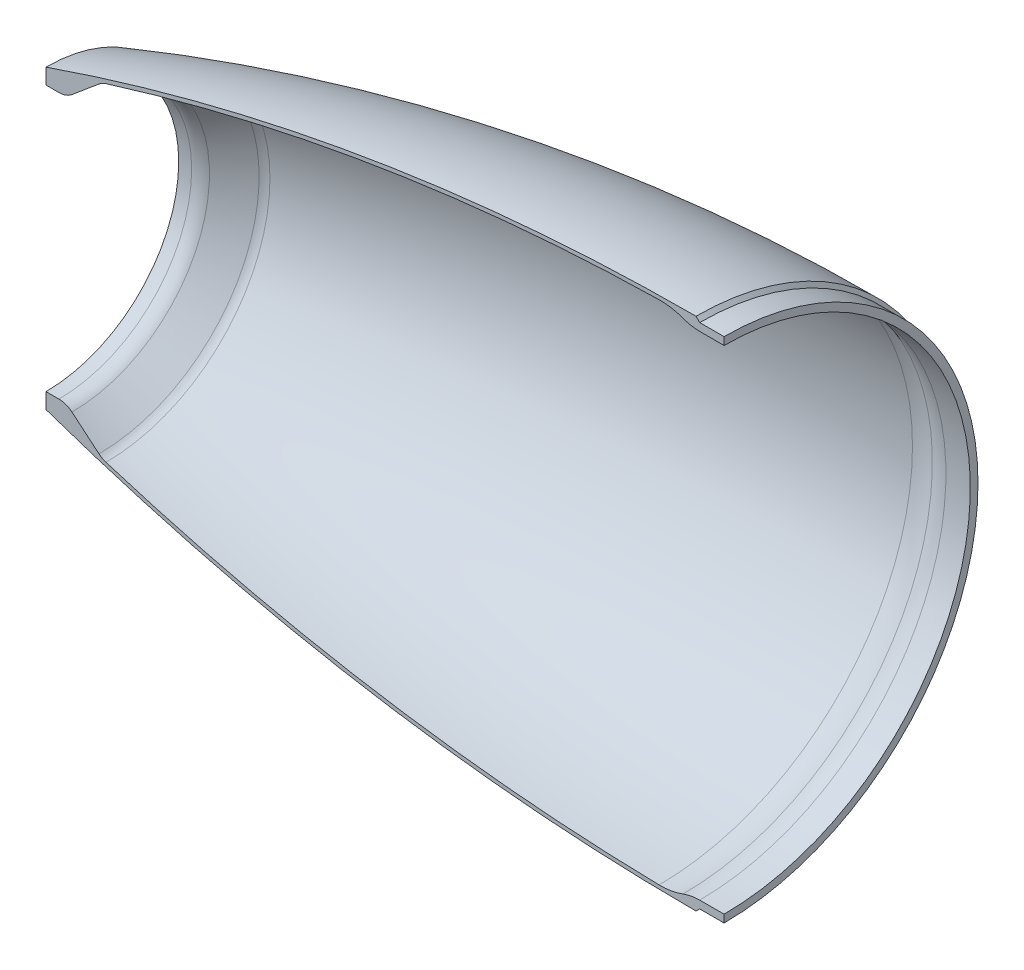
ISO-10303-21;
HEADER;
FILE_DESCRIPTION(('STEP AP214'),'2;1');
FILE_NAME('part.step','',(''),(''),'','','');
FILE_SCHEMA(('AUTOMOTIVE_DESIGN { 1 0 10303 214 1 1 1 1 }'));
ENDSEC;
DATA;
#1=APPLICATION_CONTEXT('core data for automotive mechanical design processes');
#2=APPLICATION_PROTOCOL_DEFINITION('international standard','automotive_design',2000,#1);
#3=PRODUCT_CONTEXT('',#1,'mechanical');
#4=PRODUCT('Part','Part','',(#3));
#5=PRODUCT_RELATED_PRODUCT_CATEGORY('part','',(#4));
#6=PRODUCT_DEFINITION_FORMATION('','',#4);
#7=PRODUCT_DEFINITION_CONTEXT('part definition',#1,'design');
#8=PRODUCT_DEFINITION('design','',#6,#7);
#9=PRODUCT_DEFINITION_SHAPE('','',#8);
#10=(LENGTH_UNIT() NAMED_UNIT(*) SI_UNIT(.MILLI.,.METRE.));
#11=(NAMED_UNIT(*) PLANE_ANGLE_UNIT() SI_UNIT($,.RADIAN.));
#12=(NAMED_UNIT(*) SI_UNIT($,.STERADIAN.) SOLID_ANGLE_UNIT());
#13=UNCERTAINTY_MEASURE_WITH_UNIT(LENGTH_MEASURE(1.E-05),#10,'distance_accuracy_value','');
#14=(GEOMETRIC_REPRESENTATION_CONTEXT(3) GLOBAL_UNCERTAINTY_ASSIGNED_CONTEXT((#13)) GLOBAL_UNIT_ASSIGNED_CONTEXT((#10,
#11,#12)) REPRESENTATION_CONTEXT('',''));
#15=CARTESIAN_POINT('',(0.,0.,0.));
#16=DIRECTION('',(0.,0.,1.));
#17=DIRECTION('',(1.,0.,0.));
#18=AXIS2_PLACEMENT_3D('',#15,#16,#17);
#19=CARTESIAN_POINT('',(-1.32216495746667E-13,0.,0.));
#20=DIRECTION('',(1.,0.,0.));
#21=DIRECTION('',(0.,1.,0.));
#22=AXIS2_PLACEMENT_3D('',#19,#20,#21);
#23=DEGENERATE_TOROIDAL_SURFACE('',#22,540.875767657992,621.393767657992,.F.);
#24=CARTESIAN_POINT('',(-203.2,0.,0.));
#25=DIRECTION('',(1.,0.,0.));
#26=DIRECTION('',(0.,1.,0.));
#27=AXIS2_PLACEMENT_3D('',#24,#25,#26);
#28=CIRCLE('',#27,46.355);
#29=CARTESIAN_POINT('',(-203.2,-46.355,3.23695234924147E-13));
#30=VERTEX_POINT('',#29);
#31=CARTESIAN_POINT('',(-203.2,46.355,0.));
#32=VERTEX_POINT('',#31);
#33=EDGE_CURVE('E11',#30,#32,#28,.T.);
#34=ORIENTED_EDGE('',*,*,#33,.T.);
#35=CARTESIAN_POINT('',(0.,-540.875767657992,0.));
#36=DIRECTION('',(0.,0.,1.));
#37=DIRECTION('',(1.,0.,0.));
#38=AXIS2_PLACEMENT_3D('',#35,#36,#37);
#39=CIRCLE('',#38,621.393767657992);
#40=CARTESIAN_POINT('',(0.,80.518,0.));
#41=VERTEX_POINT('',#40);
#42=EDGE_CURVE('E133',#41,#32,#39,.T.);
#43=ORIENTED_EDGE('',*,*,#42,.F.);
#44=CARTESIAN_POINT('',(0.,0.,0.));
#45=DIRECTION('',(1.,0.,0.));
#46=DIRECTION('',(0.,1.,0.));
#47=AXIS2_PLACEMENT_3D('',#44,#45,#46);
#48=CIRCLE('',#47,80.518);
#49=CARTESIAN_POINT('',(0.,-80.518,5.62254188881943E-13));
#50=VERTEX_POINT('',#49);
#51=EDGE_CURVE('E54',#50,#41,#48,.T.);
#52=ORIENTED_EDGE('',*,*,#51,.F.);
#53=CARTESIAN_POINT('',(-1.98454673506539E-13,540.875767657992,-3.77691529882066E-12));
#54=DIRECTION('',(0.,0.,-1.));
#55=DIRECTION('',(1.,0.,0.));
#56=AXIS2_PLACEMENT_3D('',#53,#54,#55);
#57=CIRCLE('',#56,621.393767657992);
#58=EDGE_CURVE('E135',#50,#30,#57,.T.);
#59=ORIENTED_EDGE('',*,*,#58,.T.);
#60=EDGE_LOOP('',(#34,#43,#52,#59));
#61=FACE_BOUND('',#60,.T.);
#62=ADVANCED_FACE('F39',(#61),#23,.F.);
#63=CARTESIAN_POINT('',(-203.2,-46.355,3.23695234924147E-13));
#64=DIRECTION('',(-1.,0.,0.));
#65=DIRECTION('',(0.,-1.,0.));
#66=AXIS2_PLACEMENT_3D('',#63,#64,#65);
#67=PLANE('',#66);
#68=CARTESIAN_POINT('',(-203.2,0.,0.));
#69=DIRECTION('',(1.,0.,0.));
#70=DIRECTION('',(0.,1.,0.));
#71=AXIS2_PLACEMENT_3D('',#68,#69,#70);
#72=CIRCLE('',#71,41.4909);
#73=CARTESIAN_POINT('',(-203.2,-41.4909,2.89729406163613E-13));
#74=VERTEX_POINT('',#73);
#75=CARTESIAN_POINT('',(-203.2,41.4909,0.));
#76=VERTEX_POINT('',#75);
#77=EDGE_CURVE('E47',#74,#76,#72,.T.);
#78=ORIENTED_EDGE('',*,*,#77,.T.);
#79=DIRECTION('',(0.,-1.,0.));
#80=VECTOR('',#79,1.);
#81=CARTESIAN_POINT('',(-203.2,46.355,0.));
#82=LINE('',#81,#80);
#83=EDGE_CURVE('E144',#32,#76,#82,.T.);
#84=ORIENTED_EDGE('',*,*,#83,.F.);
#85=ORIENTED_EDGE('',*,*,#33,.F.);
#86=DIRECTION('',(0.,1.,0.));
#87=VECTOR('',#86,1.);
#88=CARTESIAN_POINT('',(-203.2,-46.355,3.23695234924147E-13));
#89=LINE('',#88,#87);
#90=EDGE_CURVE('E181',#30,#74,#89,.T.);
#91=ORIENTED_EDGE('',*,*,#90,.T.);
#92=EDGE_LOOP('',(#78,#84,#85,#91));
#93=FACE_BOUND('',#92,.T.);
#94=ADVANCED_FACE('F41',(#93),#67,.T.);
#95=CARTESIAN_POINT('',(0.,0.,0.));
#96=DIRECTION('',(1.,0.,0.));
#97=DIRECTION('',(0.,1.,0.));
#98=AXIS2_PLACEMENT_3D('',#95,#96,#97);
#99=CYLINDRICAL_SURFACE('',#98,41.4909);
#100=CARTESIAN_POINT('',(-199.16121098759,0.,0.));
#101=DIRECTION('',(1.,0.,0.));
#102=DIRECTION('',(0.,1.,0.));
#103=AXIS2_PLACEMENT_3D('',#100,#101,#102);
#104=CIRCLE('',#103,41.4909);
#105=CARTESIAN_POINT('',(-199.16121098759,-41.4909,2.89729406163613E-13));
#106=VERTEX_POINT('',#105);
#107=CARTESIAN_POINT('',(-199.16121098759,41.4909,0.));
#108=VERTEX_POINT('',#107);
#109=EDGE_CURVE('E232',#106,#108,#104,.T.);
#110=ORIENTED_EDGE('',*,*,#109,.T.);
#111=DIRECTION('',(1.,0.,0.));
#112=VECTOR('',#111,1.);
#113=CARTESIAN_POINT('',(-203.2,41.4909,0.));
#114=LINE('',#113,#112);
#115=EDGE_CURVE('E149',#76,#108,#114,.T.);
#116=ORIENTED_EDGE('',*,*,#115,.F.);
#117=ORIENTED_EDGE('',*,*,#77,.F.);
#118=DIRECTION('',(1.,0.,0.));
#119=VECTOR('',#118,1.);
#120=CARTESIAN_POINT('',(-203.2,-41.4909,2.89729406163613E-13));
#121=LINE('',#120,#119);
#122=EDGE_CURVE('E183',#74,#106,#121,.T.);
#123=ORIENTED_EDGE('',*,*,#122,.T.);
#124=EDGE_LOOP('',(#110,#116,#117,#123));
#125=FACE_BOUND('',#124,.T.);
#126=ADVANCED_FACE('F234',(#125),#99,.F.);
#127=CARTESIAN_POINT('',(-199.16121098759,0.,0.));
#128=DIRECTION('',(1.,0.,0.));
#129=DIRECTION('',(0.,1.,0.));
#130=AXIS2_PLACEMENT_3D('',#127,#128,#129);
#131=TOROIDAL_SURFACE('',#130,47.8409,6.35);
#132=CARTESIAN_POINT('',(-195.079509666081,0.,0.));
#133=DIRECTION('',(1.,0.,0.));
#134=DIRECTION('',(0.,1.,0.));
#135=AXIS2_PLACEMENT_3D('',#132,#133,#134);
#136=CIRCLE('',#135,42.9765177861945);
#137=CARTESIAN_POINT('',(-195.079509666081,-42.9765177861945,3.00103419717916E-13));
#138=VERTEX_POINT('',#137);
#139=CARTESIAN_POINT('',(-195.079509666081,42.9765177861945,0.));
#140=VERTEX_POINT('',#139);
#141=EDGE_CURVE('E230',#138,#140,#136,.T.);
#142=ORIENTED_EDGE('',*,*,#141,.T.);
#143=CARTESIAN_POINT('',(-199.16121098759,47.8409,0.));
#144=DIRECTION('',(0.,0.,1.));
#145=DIRECTION('',(1.,0.,0.));
#146=AXIS2_PLACEMENT_3D('',#143,#144,#145);
#147=CIRCLE('',#146,6.35);
#148=EDGE_CURVE('E151',#108,#140,#147,.T.);
#149=ORIENTED_EDGE('',*,*,#148,.F.);
#150=ORIENTED_EDGE('',*,*,#109,.F.);
#151=CARTESIAN_POINT('',(-199.16121098759,-47.8409,3.34071219166921E-13));
#152=DIRECTION('',(0.,0.,-1.));
#153=DIRECTION('',(1.,0.,0.));
#154=AXIS2_PLACEMENT_3D('',#151,#152,#153);
#155=CIRCLE('',#154,6.35);
#156=EDGE_CURVE('E186',#106,#138,#155,.T.);
#157=ORIENTED_EDGE('',*,*,#156,.T.);
#158=EDGE_LOOP('',(#142,#149,#150,#157));
#159=FACE_BOUND('',#158,.T.);
#160=ADVANCED_FACE('F240',(#159),#131,.T.);
#161=CARTESIAN_POINT('',(-195.079509666081,0.,0.));
#162=DIRECTION('',(1.,0.,0.));
#163=DIRECTION('',(0.,1.,0.));
#164=AXIS2_PLACEMENT_3D('',#161,#162,#163);
#165=CONICAL_SURFACE('',#164,42.9765177861945,0.698131700797734);
#166=CARTESIAN_POINT('',(-186.641312326434,0.,0.));
#167=DIRECTION('',(1.,0.,0.));
#168=DIRECTION('',(0.,1.,0.));
#169=AXIS2_PLACEMENT_3D('',#166,#167,#168);
#170=CIRCLE('',#169,50.0570060616936);
#171=CARTESIAN_POINT('',(-186.641312326434,-50.0570060616936,3.49546205085522E-13));
#172=VERTEX_POINT('',#171);
#173=CARTESIAN_POINT('',(-186.641312326434,50.0570060616936,0.));
#174=VERTEX_POINT('',#173);
#175=EDGE_CURVE('E228',#172,#174,#170,.T.);
#176=ORIENTED_EDGE('',*,*,#175,.T.);
#177=DIRECTION('',(0.766044443118976,0.642787609686541,0.));
#178=VECTOR('',#177,1.);
#179=CARTESIAN_POINT('',(-195.079509666081,42.9765177861945,0.));
#180=LINE('',#179,#178);
#181=EDGE_CURVE('E156',#140,#174,#180,.T.);
#182=ORIENTED_EDGE('',*,*,#181,.F.);
#183=ORIENTED_EDGE('',*,*,#141,.F.);
#184=DIRECTION('',(0.766044443118976,-0.642787609686541,0.));
#185=VECTOR('',#184,1.);
#186=CARTESIAN_POINT('',(-195.079509666081,-42.9765177861945,3.00103419717916E-13));
#187=LINE('',#186,#185);
#188=EDGE_CURVE('E189',#138,#172,#187,.T.);
#189=ORIENTED_EDGE('',*,*,#188,.T.);
#190=EDGE_LOOP('',(#176,#182,#183,#189));
#191=FACE_BOUND('',#190,.T.);
#192=ADVANCED_FACE('F243',(#191),#165,.F.);
#193=CARTESIAN_POINT('',(-182.559611004924,0.,0.));
#194=DIRECTION('',(1.,0.,0.));
#195=DIRECTION('',(0.,1.,0.));
#196=AXIS2_PLACEMENT_3D('',#193,#194,#195);
#197=TOROIDAL_SURFACE('',#196,45.1926238478883,6.34999999999979);
#198=CARTESIAN_POINT('',(-184.4481266028,0.,0.));
#199=DIRECTION('',(1.,0.,0.));
#200=DIRECTION('',(0.,1.,0.));
#201=AXIS2_PLACEMENT_3D('',#198,#199,#200);
#202=CIRCLE('',#201,51.2552972546103);
#203=CARTESIAN_POINT('',(-184.4481266028,-51.2552972546104,3.57913827762659E-13));
#204=VERTEX_POINT('',#203);
#205=CARTESIAN_POINT('',(-184.4481266028,51.2552972546103,0.));
#206=VERTEX_POINT('',#205);
#207=EDGE_CURVE('E226',#204,#206,#202,.T.);
#208=ORIENTED_EDGE('',*,*,#207,.T.);
#209=CARTESIAN_POINT('',(-182.559611004924,45.1926238478882,0.));
#210=DIRECTION('',(0.,0.,-1.));
#211=DIRECTION('',(1.,0.,0.));
#212=AXIS2_PLACEMENT_3D('',#209,#210,#211);
#213=CIRCLE('',#212,6.34999999999979);
#214=EDGE_CURVE('E159',#174,#206,#213,.T.);
#215=ORIENTED_EDGE('',*,*,#214,.F.);
#216=ORIENTED_EDGE('',*,*,#175,.F.);
#217=CARTESIAN_POINT('',(-182.559611004924,-45.1926238478883,3.15578405636518E-13));
#218=DIRECTION('',(0.,0.,1.));
#219=DIRECTION('',(1.,0.,0.));
#220=AXIS2_PLACEMENT_3D('',#217,#218,#219);
#221=CIRCLE('',#220,6.34999999999979);
#222=EDGE_CURVE('E192',#172,#204,#221,.T.);
#223=ORIENTED_EDGE('',*,*,#222,.T.);
#224=EDGE_LOOP('',(#208,#215,#216,#223));
#225=FACE_BOUND('',#224,.T.);
#226=ADVANCED_FACE('F248',(#225),#197,.F.);
#227=CARTESIAN_POINT('',(-1.32216495746667E-13,0.,0.));
#228=DIRECTION('',(1.,0.,0.));
#229=DIRECTION('',(0.,1.,0.));
#230=AXIS2_PLACEMENT_3D('',#227,#228,#229);
#231=DEGENERATE_TOROIDAL_SURFACE('',#230,540.875767657992,620.193767657991,.F.);
#232=CARTESIAN_POINT('',(-11.557,0.,0.));
#233=DIRECTION('',(1.,0.,0.));
#234=DIRECTION('',(0.,1.,0.));
#235=AXIS2_PLACEMENT_3D('',#232,#233,#234);
#236=CIRCLE('',#235,79.210311199464);
#237=CARTESIAN_POINT('',(-11.557,-79.210311199464,5.53122646793771E-13));
#238=VERTEX_POINT('',#237);
#239=CARTESIAN_POINT('',(-11.557,79.210311199464,0.));
#240=VERTEX_POINT('',#239);
#241=EDGE_CURVE('E224',#238,#240,#236,.T.);
#242=ORIENTED_EDGE('',*,*,#241,.T.);
#243=CARTESIAN_POINT('',(0.,-540.875767657992,0.));
#244=DIRECTION('',(0.,0.,-1.));
#245=DIRECTION('',(1.,0.,0.));
#246=AXIS2_PLACEMENT_3D('',#243,#244,#245);
#247=CIRCLE('',#246,620.193767657991);
#248=EDGE_CURVE('E162',#206,#240,#247,.T.);
#249=ORIENTED_EDGE('',*,*,#248,.F.);
#250=ORIENTED_EDGE('',*,*,#207,.F.);
#251=CARTESIAN_POINT('',(-1.98454673506539E-13,540.875767657992,-3.77691529882066E-12));
#252=DIRECTION('',(0.,0.,1.));
#253=DIRECTION('',(1.,0.,0.));
#254=AXIS2_PLACEMENT_3D('',#251,#252,#253);
#255=CIRCLE('',#254,620.193767657991);
#256=EDGE_CURVE('E195',#204,#238,#255,.T.);
#257=ORIENTED_EDGE('',*,*,#256,.T.);
#258=EDGE_LOOP('',(#242,#249,#250,#257));
#259=FACE_BOUND('',#258,.T.);
#260=ADVANCED_FACE('F251',(#259),#231,.T.);
#261=CARTESIAN_POINT('',(-11.1790647652095,0.,0.));
#262=DIRECTION('',(1.,0.,0.));
#263=DIRECTION('',(0.,1.,0.));
#264=AXIS2_PLACEMENT_3D('',#261,#262,#263);
#265=TOROIDAL_SURFACE('',#264,58.9323517114194,20.2814811106209);
#266=CARTESIAN_POINT('',(-4.04458467874521,0.,0.));
#267=DIRECTION('',(1.,0.,0.));
#268=DIRECTION('',(0.,1.,0.));
#269=AXIS2_PLACEMENT_3D('',#266,#267,#268);
#270=CIRCLE('',#269,77.9175477845791);
#271=CARTESIAN_POINT('',(-4.0445846787452,-77.9175477845791,5.44095328116552E-13));
#272=VERTEX_POINT('',#271);
#273=CARTESIAN_POINT('',(-4.04458467874522,77.9175477845791,0.));
#274=VERTEX_POINT('',#273);
#275=EDGE_CURVE('E222',#272,#274,#270,.T.);
#276=ORIENTED_EDGE('',*,*,#275,.T.);
#277=CARTESIAN_POINT('',(-11.1790647652095,58.9323517114194,0.));
#278=DIRECTION('',(0.,0.,-1.));
#279=DIRECTION('',(-1.,0.,0.));
#280=AXIS2_PLACEMENT_3D('',#277,#278,#279);
#281=CIRCLE('',#280,20.2814811106209);
#282=EDGE_CURVE('E165',#240,#274,#281,.T.);
#283=ORIENTED_EDGE('',*,*,#282,.F.);
#284=ORIENTED_EDGE('',*,*,#241,.F.);
#285=CARTESIAN_POINT('',(-11.1790647652095,-58.9323517114194,4.11522412509122E-13));
#286=DIRECTION('',(0.,0.,1.));
#287=DIRECTION('',(-1.,0.,0.));
#288=AXIS2_PLACEMENT_3D('',#285,#286,#287);
#289=CIRCLE('',#288,20.2814811106209);
#290=EDGE_CURVE('E198',#238,#272,#289,.T.);
#291=ORIENTED_EDGE('',*,*,#290,.T.);
#292=EDGE_LOOP('',(#276,#283,#284,#291));
#293=FACE_BOUND('',#292,.T.);
#294=ADVANCED_FACE('F256',(#293),#265,.F.);
#295=CARTESIAN_POINT('',(1.143,0.,0.));
#296=DIRECTION('',(1.,0.,0.));
#297=DIRECTION('',(0.,1.,0.));
#298=AXIS2_PLACEMENT_3D('',#295,#296,#297);
#299=TOROIDAL_SURFACE('',#298,91.7219611515671,14.7469611515671);
#300=CARTESIAN_POINT('',(1.14299999999999,0.,0.));
#301=DIRECTION('',(1.,0.,0.));
#302=DIRECTION('',(0.,1.,0.));
#303=AXIS2_PLACEMENT_3D('',#300,#301,#302);
#304=CIRCLE('',#303,76.975);
#305=CARTESIAN_POINT('',(1.143,-76.975,5.375135521149E-13));
#306=VERTEX_POINT('',#305);
#307=CARTESIAN_POINT('',(1.14299999999998,76.975,0.));
#308=VERTEX_POINT('',#307);
#309=EDGE_CURVE('E220',#306,#308,#304,.T.);
#310=ORIENTED_EDGE('',*,*,#309,.T.);
#311=CARTESIAN_POINT('',(1.14299999999999,91.7219611515671,0.));
#312=DIRECTION('',(0.,0.,1.));
#313=DIRECTION('',(1.,0.,0.));
#314=AXIS2_PLACEMENT_3D('',#311,#312,#313);
#315=CIRCLE('',#314,14.7469611515671);
#316=EDGE_CURVE('E168',#274,#308,#315,.T.);
#317=ORIENTED_EDGE('',*,*,#316,.F.);
#318=ORIENTED_EDGE('',*,*,#275,.F.);
#319=CARTESIAN_POINT('',(1.14300000000002,-91.7219611515671,6.40491031445582E-13));
#320=DIRECTION('',(0.,0.,-1.));
#321=DIRECTION('',(1.,0.,0.));
#322=AXIS2_PLACEMENT_3D('',#319,#320,#321);
#323=CIRCLE('',#322,14.7469611515671);
#324=EDGE_CURVE('E201',#272,#306,#323,.T.);
#325=ORIENTED_EDGE('',*,*,#324,.T.);
#326=EDGE_LOOP('',(#310,#317,#318,#325));
#327=FACE_BOUND('',#326,.T.);
#328=ADVANCED_FACE('F259',(#327),#299,.T.);
#329=CARTESIAN_POINT('',(0.,0.,0.));
#330=DIRECTION('',(1.,0.,0.));
#331=DIRECTION('',(0.,1.,0.));
#332=AXIS2_PLACEMENT_3D('',#329,#330,#331);
#333=CYLINDRICAL_SURFACE('',#332,76.975);
#334=CARTESIAN_POINT('',(8.76299999999953,0.,0.));
#335=DIRECTION('',(1.,0.,0.));
#336=DIRECTION('',(0.,1.,0.));
#337=AXIS2_PLACEMENT_3D('',#334,#335,#336);
#338=CIRCLE('',#337,76.975);
#339=CARTESIAN_POINT('',(8.76299999999954,-76.975,5.375135521149E-13));
#340=VERTEX_POINT('',#339);
#341=CARTESIAN_POINT('',(8.76299999999952,76.975,0.));
#342=VERTEX_POINT('',#341);
#343=EDGE_CURVE('E218',#340,#342,#338,.T.);
#344=ORIENTED_EDGE('',*,*,#343,.T.);
#345=DIRECTION('',(1.,0.,0.));
#346=VECTOR('',#345,1.);
#347=CARTESIAN_POINT('',(1.14299999999998,76.975,0.));
#348=LINE('',#347,#346);
#349=EDGE_CURVE('E171',#308,#342,#348,.T.);
#350=ORIENTED_EDGE('',*,*,#349,.F.);
#351=ORIENTED_EDGE('',*,*,#309,.F.);
#352=DIRECTION('',(1.,0.,0.));
#353=VECTOR('',#352,1.);
#354=CARTESIAN_POINT('',(1.143,-76.975,5.375135521149E-13));
#355=LINE('',#354,#353);
#356=EDGE_CURVE('E204',#306,#340,#355,.T.);
#357=ORIENTED_EDGE('',*,*,#356,.T.);
#358=EDGE_LOOP('',(#344,#350,#351,#357));
#359=FACE_BOUND('',#358,.T.);
#360=ADVANCED_FACE('F264',(#359),#333,.F.);
#361=CARTESIAN_POINT('',(8.76299999999954,-76.975,5.375135521149E-13));
#362=DIRECTION('',(1.,0.,0.));
#363=DIRECTION('',(0.,1.,0.));
#364=AXIS2_PLACEMENT_3D('',#361,#362,#363);
#365=PLANE('',#364);
#366=CARTESIAN_POINT('',(8.76299999999953,0.,0.));
#367=DIRECTION('',(1.,0.,0.));
#368=DIRECTION('',(0.,1.,0.));
#369=AXIS2_PLACEMENT_3D('',#366,#367,#368);
#370=CIRCLE('',#369,79.375);
#371=CARTESIAN_POINT('',(8.76299999999954,-79.375,5.54272662541347E-13));
#372=VERTEX_POINT('',#371);
#373=CARTESIAN_POINT('',(8.76299999999952,79.375,0.));
#374=VERTEX_POINT('',#373);
#375=EDGE_CURVE('E216',#372,#374,#370,.T.);
#376=ORIENTED_EDGE('',*,*,#375,.T.);
#377=DIRECTION('',(0.,1.,0.));
#378=VECTOR('',#377,1.);
#379=CARTESIAN_POINT('',(8.76299999999952,76.975,0.));
#380=LINE('',#379,#378);
#381=EDGE_CURVE('E174',#342,#374,#380,.T.);
#382=ORIENTED_EDGE('',*,*,#381,.F.);
#383=ORIENTED_EDGE('',*,*,#343,.F.);
#384=DIRECTION('',(0.,-1.,0.));
#385=VECTOR('',#384,1.);
#386=CARTESIAN_POINT('',(8.76299999999954,-76.975,5.375135521149E-13));
#387=LINE('',#386,#385);
#388=EDGE_CURVE('E207',#340,#372,#387,.T.);
#389=ORIENTED_EDGE('',*,*,#388,.T.);
#390=EDGE_LOOP('',(#376,#382,#383,#389));
#391=FACE_BOUND('',#390,.T.);
#392=ADVANCED_FACE('F267',(#391),#365,.T.);
#393=CARTESIAN_POINT('',(0.,0.,0.));
#394=DIRECTION('',(1.,0.,0.));
#395=DIRECTION('',(0.,1.,0.));
#396=AXIS2_PLACEMENT_3D('',#393,#394,#395);
#397=CYLINDRICAL_SURFACE('',#396,79.375);
#398=CARTESIAN_POINT('',(1.1429999999996,0.,0.));
#399=DIRECTION('',(1.,0.,0.));
#400=DIRECTION('',(0.,1.,0.));
#401=AXIS2_PLACEMENT_3D('',#398,#399,#400);
#402=CIRCLE('',#401,79.375);
#403=CARTESIAN_POINT('',(1.1429999999996,-79.375,5.54272662541347E-13));
#404=VERTEX_POINT('',#403);
#405=CARTESIAN_POINT('',(1.14299999999959,79.375,0.));
#406=VERTEX_POINT('',#405);
#407=EDGE_CURVE('E62',#404,#406,#402,.T.);
#408=ORIENTED_EDGE('',*,*,#407,.T.);
#409=DIRECTION('',(-1.,0.,0.));
#410=VECTOR('',#409,1.);
#411=CARTESIAN_POINT('',(1.14299999999959,79.375,0.));
#412=LINE('',#411,#410);
#413=EDGE_CURVE('E177',#374,#406,#412,.T.);
#414=ORIENTED_EDGE('',*,*,#413,.F.);
#415=ORIENTED_EDGE('',*,*,#375,.F.);
#416=DIRECTION('',(-1.,0.,0.));
#417=VECTOR('',#416,1.);
#418=CARTESIAN_POINT('',(1.1429999999996,-79.375,5.54272662541347E-13));
#419=LINE('',#418,#417);
#420=EDGE_CURVE('E210',#372,#404,#419,.T.);
#421=ORIENTED_EDGE('',*,*,#420,.T.);
#422=EDGE_LOOP('',(#408,#414,#415,#421));
#423=FACE_BOUND('',#422,.T.);
#424=ADVANCED_FACE('F271',(#423),#397,.T.);
#425=CARTESIAN_POINT('',(1.1429999999996,0.,0.));
#426=DIRECTION('',(-1.,0.,0.));
#427=DIRECTION('',(0.,-1.,0.));
#428=AXIS2_PLACEMENT_3D('',#425,#426,#427);
#429=CONICAL_SURFACE('',#428,79.375,0.785398163397619);
#430=DIRECTION('',(-0.707106781186427,-0.707106781186668,0.));
#431=VECTOR('',#430,1.);
#432=CARTESIAN_POINT('',(0.,-80.518,5.62254188881943E-13));
#433=LINE('',#432,#431);
#434=EDGE_CURVE('E212',#404,#50,#433,.T.);
#435=ORIENTED_EDGE('',*,*,#434,.T.);
#436=ORIENTED_EDGE('',*,*,#51,.T.);
#437=DIRECTION('',(-0.707106781186427,0.707106781186668,0.));
#438=VECTOR('',#437,1.);
#439=CARTESIAN_POINT('',(0.,80.518,0.));
#440=LINE('',#439,#438);
#441=EDGE_CURVE('E147',#406,#41,#440,.T.);
#442=ORIENTED_EDGE('',*,*,#441,.F.);
#443=ORIENTED_EDGE('',*,*,#407,.F.);
#444=EDGE_LOOP('',(#435,#436,#442,#443));
#445=FACE_BOUND('',#444,.T.);
#446=ADVANCED_FACE('F275',(#445),#429,.T.);
#447=CARTESIAN_POINT('',(-1.98454673506539E-13,540.875767657992,-3.77691529882066E-12));
#448=DIRECTION('',(0.,0.,-1.));
#449=DIRECTION('',(1.,0.,0.));
#450=AXIS2_PLACEMENT_3D('',#447,#448,#449);
#451=PLANE('',#450);
#452=ORIENTED_EDGE('',*,*,#58,.F.);
#453=ORIENTED_EDGE('',*,*,#434,.F.);
#454=ORIENTED_EDGE('',*,*,#420,.F.);
#455=ORIENTED_EDGE('',*,*,#388,.F.);
#456=ORIENTED_EDGE('',*,*,#356,.F.);
#457=ORIENTED_EDGE('',*,*,#324,.F.);
#458=ORIENTED_EDGE('',*,*,#290,.F.);
#459=ORIENTED_EDGE('',*,*,#256,.F.);
#460=ORIENTED_EDGE('',*,*,#222,.F.);
#461=ORIENTED_EDGE('',*,*,#188,.F.);
#462=ORIENTED_EDGE('',*,*,#156,.F.);
#463=ORIENTED_EDGE('',*,*,#122,.F.);
#464=ORIENTED_EDGE('',*,*,#90,.F.);
#465=EDGE_LOOP('',(#452,#453,#454,#455,#456,#457,#458,#459,#460,#461,#462,#463,#464));
#466=FACE_BOUND('',#465,.T.);
#467=ADVANCED_FACE('F274',(#466),#451,.F.);
#468=CARTESIAN_POINT('',(0.,-540.875767657992,0.));
#469=DIRECTION('',(0.,0.,1.));
#470=DIRECTION('',(1.,0.,0.));
#471=AXIS2_PLACEMENT_3D('',#468,#469,#470);
#472=PLANE('',#471);
#473=ORIENTED_EDGE('',*,*,#42,.T.);
#474=ORIENTED_EDGE('',*,*,#83,.T.);
#475=ORIENTED_EDGE('',*,*,#115,.T.);
#476=ORIENTED_EDGE('',*,*,#148,.T.);
#477=ORIENTED_EDGE('',*,*,#181,.T.);
#478=ORIENTED_EDGE('',*,*,#214,.T.);
#479=ORIENTED_EDGE('',*,*,#248,.T.);
#480=ORIENTED_EDGE('',*,*,#282,.T.);
#481=ORIENTED_EDGE('',*,*,#316,.T.);
#482=ORIENTED_EDGE('',*,*,#349,.T.);
#483=ORIENTED_EDGE('',*,*,#381,.T.);
#484=ORIENTED_EDGE('',*,*,#413,.T.);
#485=ORIENTED_EDGE('',*,*,#441,.T.);
#486=EDGE_LOOP('',(#473,#474,#475,#476,#477,#478,#479,#480,#481,#482,#483,#484,#485));
#487=FACE_BOUND('',#486,.T.);
#488=ADVANCED_FACE('F142',(#487),#472,.T.);
#489=CLOSED_SHELL('',(#62,#94,#126,#160,#192,#226,#260,#294,#328,#360,#392,#424,#446,#467,#488));
#490=MANIFOLD_SOLID_BREP('B2',#489);
#491=ADVANCED_BREP_SHAPE_REPRESENTATION('',(#18,#490),#14);
#492=SHAPE_DEFINITION_REPRESENTATION(#9,#491);
ENDSEC;
END-ISO-10303-21;
